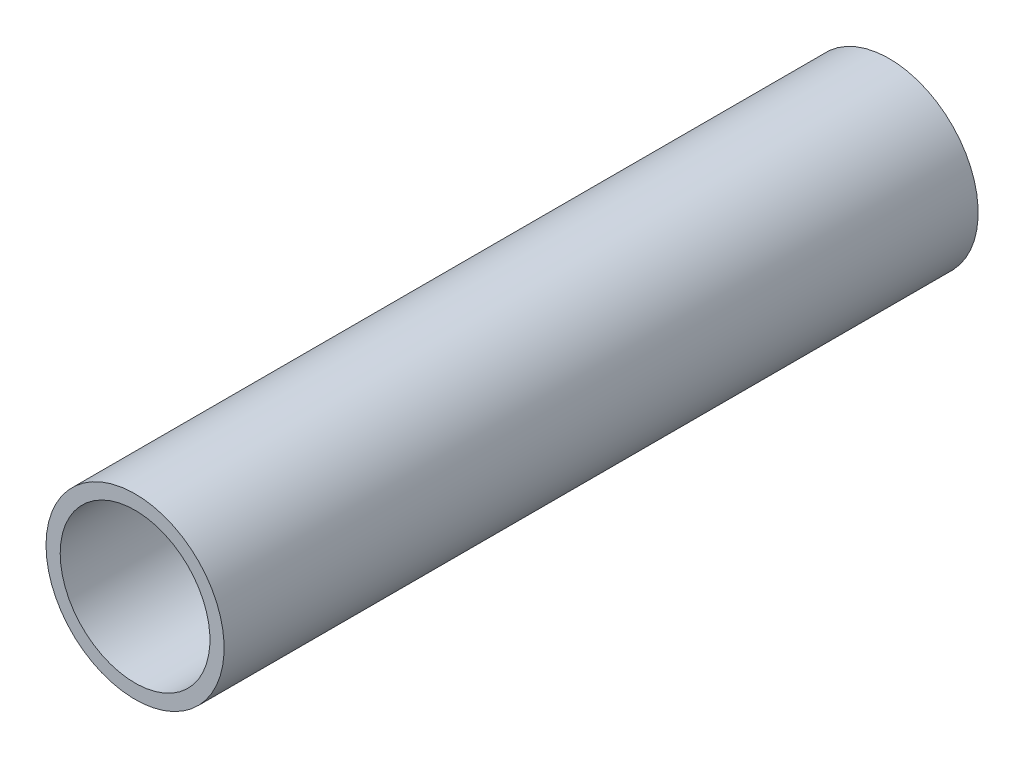
ISO-10303-21;
HEADER;
FILE_DESCRIPTION(('STEP AP214'),'2;1');
FILE_NAME('part.step','',(''),(''),'','','');
FILE_SCHEMA(('AUTOMOTIVE_DESIGN { 1 0 10303 214 1 1 1 1 }'));
ENDSEC;
DATA;
#1=APPLICATION_CONTEXT('core data for automotive mechanical design processes');
#2=APPLICATION_PROTOCOL_DEFINITION('international standard','automotive_design',2000,#1);
#3=PRODUCT_CONTEXT('',#1,'mechanical');
#4=PRODUCT('Part','Part','',(#3));
#5=PRODUCT_RELATED_PRODUCT_CATEGORY('part','',(#4));
#6=PRODUCT_DEFINITION_FORMATION('','',#4);
#7=PRODUCT_DEFINITION_CONTEXT('part definition',#1,'design');
#8=PRODUCT_DEFINITION('design','',#6,#7);
#9=PRODUCT_DEFINITION_SHAPE('','',#8);
#10=(LENGTH_UNIT() NAMED_UNIT(*) SI_UNIT(.MILLI.,.METRE.));
#11=(NAMED_UNIT(*) PLANE_ANGLE_UNIT() SI_UNIT($,.RADIAN.));
#12=(NAMED_UNIT(*) SI_UNIT($,.STERADIAN.) SOLID_ANGLE_UNIT());
#13=UNCERTAINTY_MEASURE_WITH_UNIT(LENGTH_MEASURE(1.E-05),#10,'distance_accuracy_value','');
#14=(GEOMETRIC_REPRESENTATION_CONTEXT(3) GLOBAL_UNCERTAINTY_ASSIGNED_CONTEXT((#13)) GLOBAL_UNIT_ASSIGNED_CONTEXT((#10,
#11,#12)) REPRESENTATION_CONTEXT('',''));
#15=CARTESIAN_POINT('',(0.,0.,0.));
#16=DIRECTION('',(0.,0.,1.));
#17=DIRECTION('',(1.,0.,0.));
#18=AXIS2_PLACEMENT_3D('',#15,#16,#17);
#19=CARTESIAN_POINT('',(0.,0.,40.48125));
#20=DIRECTION('',(0.,0.,-1.));
#21=DIRECTION('',(-1.,0.,0.));
#22=AXIS2_PLACEMENT_3D('',#19,#20,#21);
#23=CYLINDRICAL_SURFACE('',#22,8.0391);
#24=CARTESIAN_POINT('',(0.,0.,-40.48125));
#25=DIRECTION('',(0.,0.,-1.));
#26=DIRECTION('',(-1.,0.,0.));
#27=AXIS2_PLACEMENT_3D('',#24,#25,#26);
#28=CIRCLE('',#27,8.0391);
#29=CARTESIAN_POINT('',(-8.0391,0.,-40.48125));
#30=VERTEX_POINT('',#29);
#31=EDGE_CURVE('E35',#30,#30,#28,.T.);
#32=ORIENTED_EDGE('',*,*,#31,.T.);
#33=EDGE_LOOP('',(#32));
#34=FACE_BOUND('',#33,.T.);
#35=CARTESIAN_POINT('',(0.,0.,40.48125));
#36=DIRECTION('',(0.,0.,-1.));
#37=DIRECTION('',(-1.,0.,0.));
#38=AXIS2_PLACEMENT_3D('',#35,#36,#37);
#39=CIRCLE('',#38,8.0391);
#40=CARTESIAN_POINT('',(-8.0391,0.,40.48125));
#41=VERTEX_POINT('',#40);
#42=EDGE_CURVE('E26',#41,#41,#39,.T.);
#43=ORIENTED_EDGE('',*,*,#42,.F.);
#44=EDGE_LOOP('',(#43));
#45=FACE_BOUND('',#44,.T.);
#46=ADVANCED_FACE('F23',(#34,#45),#23,.F.);
#47=CARTESIAN_POINT('',(0.,0.,40.48125));
#48=DIRECTION('',(0.,0.,1.));
#49=DIRECTION('',(1.,0.,0.));
#50=AXIS2_PLACEMENT_3D('',#47,#48,#49);
#51=PLANE('',#50);
#52=ORIENTED_EDGE('',*,*,#42,.T.);
#53=EDGE_LOOP('',(#52));
#54=FACE_BOUND('',#53,.T.);
#55=CARTESIAN_POINT('',(0.,0.,40.48125));
#56=DIRECTION('',(0.,0.,-1.));
#57=DIRECTION('',(-1.,0.,0.));
#58=AXIS2_PLACEMENT_3D('',#55,#56,#57);
#59=CIRCLE('',#58,9.5631);
#60=CARTESIAN_POINT('',(-9.5631,0.,40.48125));
#61=VERTEX_POINT('',#60);
#62=EDGE_CURVE('E30',#61,#61,#59,.T.);
#63=ORIENTED_EDGE('',*,*,#62,.F.);
#64=EDGE_LOOP('',(#63));
#65=FACE_BOUND('',#64,.T.);
#66=ADVANCED_FACE('F43',(#54,#65),#51,.T.);
#67=CARTESIAN_POINT('',(0.,0.,-40.48125));
#68=DIRECTION('',(0.,0.,1.));
#69=DIRECTION('',(1.,0.,0.));
#70=AXIS2_PLACEMENT_3D('',#67,#68,#69);
#71=PLANE('',#70);
#72=ORIENTED_EDGE('',*,*,#31,.F.);
#73=EDGE_LOOP('',(#72));
#74=FACE_BOUND('',#73,.T.);
#75=CARTESIAN_POINT('',(0.,0.,-40.48125));
#76=DIRECTION('',(0.,0.,-1.));
#77=DIRECTION('',(-1.,0.,0.));
#78=AXIS2_PLACEMENT_3D('',#75,#76,#77);
#79=CIRCLE('',#78,9.5631);
#80=CARTESIAN_POINT('',(-9.5631,0.,-40.48125));
#81=VERTEX_POINT('',#80);
#82=EDGE_CURVE('E12',#81,#81,#79,.F.);
#83=ORIENTED_EDGE('',*,*,#82,.F.);
#84=EDGE_LOOP('',(#83));
#85=FACE_BOUND('',#84,.T.);
#86=ADVANCED_FACE('F51',(#74,#85),#71,.F.);
#87=CARTESIAN_POINT('',(0.,0.,40.48125));
#88=DIRECTION('',(0.,0.,-1.));
#89=DIRECTION('',(-1.,0.,0.));
#90=AXIS2_PLACEMENT_3D('',#87,#88,#89);
#91=CYLINDRICAL_SURFACE('',#90,9.5631);
#92=ORIENTED_EDGE('',*,*,#82,.T.);
#93=EDGE_LOOP('',(#92));
#94=FACE_BOUND('',#93,.T.);
#95=ORIENTED_EDGE('',*,*,#62,.T.);
#96=EDGE_LOOP('',(#95));
#97=FACE_BOUND('',#96,.T.);
#98=ADVANCED_FACE('F52',(#94,#97),#91,.T.);
#99=CLOSED_SHELL('',(#46,#66,#86,#98));
#100=MANIFOLD_SOLID_BREP('B1',#99);
#101=ADVANCED_BREP_SHAPE_REPRESENTATION('',(#18,#100),#14);
#102=SHAPE_DEFINITION_REPRESENTATION(#9,#101);
ENDSEC;
END-ISO-10303-21;
